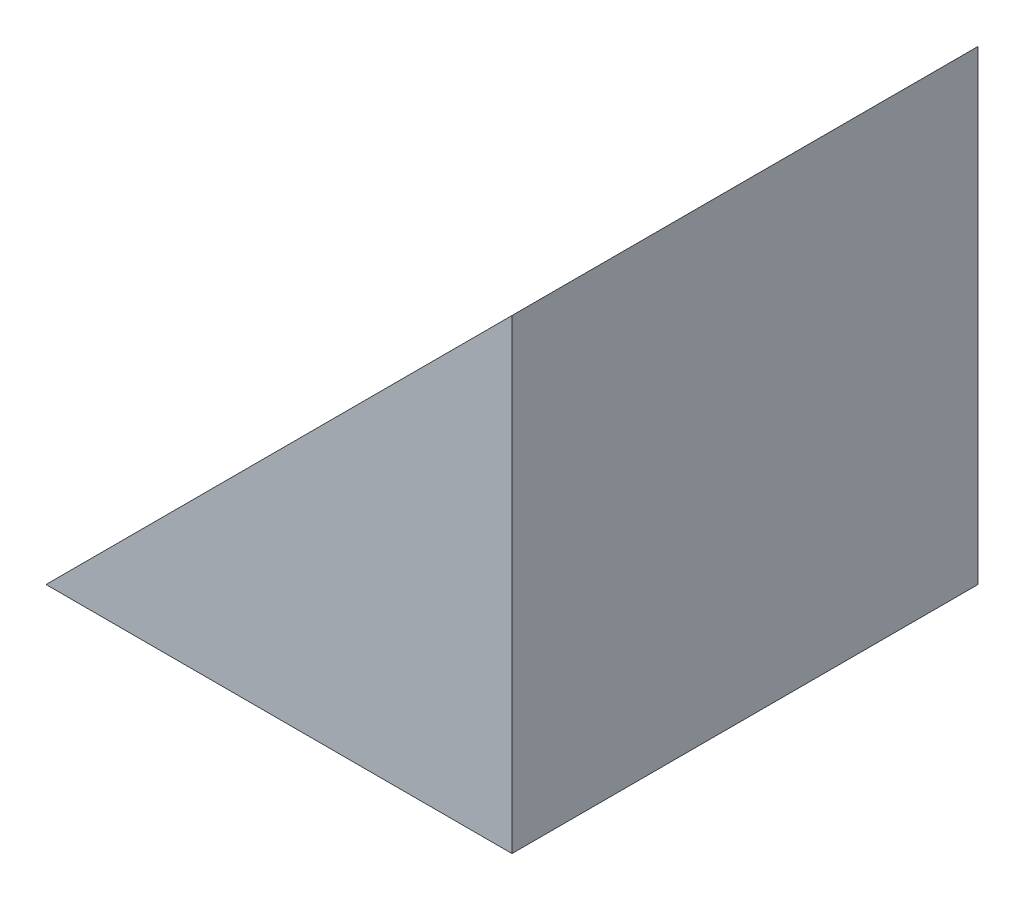
ISO-10303-21;
HEADER;
FILE_DESCRIPTION(('STEP AP214'),'2;1');
FILE_NAME('part.step','',(''),(''),'','','');
FILE_SCHEMA(('AUTOMOTIVE_DESIGN { 1 0 10303 214 1 1 1 1 }'));
ENDSEC;
DATA;
#1=APPLICATION_CONTEXT('core data for automotive mechanical design processes');
#2=APPLICATION_PROTOCOL_DEFINITION('international standard','automotive_design',2000,#1);
#3=PRODUCT_CONTEXT('',#1,'mechanical');
#4=PRODUCT('Part','Part','',(#3));
#5=PRODUCT_RELATED_PRODUCT_CATEGORY('part','',(#4));
#6=PRODUCT_DEFINITION_FORMATION('','',#4);
#7=PRODUCT_DEFINITION_CONTEXT('part definition',#1,'design');
#8=PRODUCT_DEFINITION('design','',#6,#7);
#9=PRODUCT_DEFINITION_SHAPE('','',#8);
#10=(LENGTH_UNIT() NAMED_UNIT(*) SI_UNIT(.MILLI.,.METRE.));
#11=(NAMED_UNIT(*) PLANE_ANGLE_UNIT() SI_UNIT($,.RADIAN.));
#12=(NAMED_UNIT(*) SI_UNIT($,.STERADIAN.) SOLID_ANGLE_UNIT());
#13=UNCERTAINTY_MEASURE_WITH_UNIT(LENGTH_MEASURE(1.E-05),#10,'distance_accuracy_value','');
#14=(GEOMETRIC_REPRESENTATION_CONTEXT(3) GLOBAL_UNCERTAINTY_ASSIGNED_CONTEXT((#13)) GLOBAL_UNIT_ASSIGNED_CONTEXT((#10,
#11,#12)) REPRESENTATION_CONTEXT('',''));
#15=CARTESIAN_POINT('',(0.,0.,0.));
#16=DIRECTION('',(0.,0.,1.));
#17=DIRECTION('',(1.,0.,0.));
#18=AXIS2_PLACEMENT_3D('',#15,#16,#17);
#19=CARTESIAN_POINT('',(104.828438226543,79.6674421441836,30.));
#20=DIRECTION('',(0.,1.,0.));
#21=DIRECTION('',(0.,0.,1.));
#22=AXIS2_PLACEMENT_3D('',#19,#20,#21);
#23=PLANE('',#22);
#24=DIRECTION('',(1.,0.,0.));
#25=VECTOR('',#24,1.);
#26=CARTESIAN_POINT('',(104.828438226543,79.6674421441836,0.));
#27=LINE('',#26,#25);
#28=CARTESIAN_POINT('',(74.8284382265434,79.6674421441836,0.));
#29=VERTEX_POINT('',#28);
#30=CARTESIAN_POINT('',(104.828438226543,79.6674421441836,0.));
#31=VERTEX_POINT('',#30);
#32=EDGE_CURVE('E89',#29,#31,#27,.T.);
#33=ORIENTED_EDGE('',*,*,#32,.T.);
#34=DIRECTION('',(0.,0.,-1.));
#35=VECTOR('',#34,1.);
#36=CARTESIAN_POINT('',(104.828438226543,79.6674421441836,30.));
#37=LINE('',#36,#35);
#38=CARTESIAN_POINT('',(104.828438226543,79.6674421441836,30.));
#39=VERTEX_POINT('',#38);
#40=EDGE_CURVE('E11',#39,#31,#37,.T.);
#41=ORIENTED_EDGE('',*,*,#40,.F.);
#42=DIRECTION('',(1.,0.,0.));
#43=VECTOR('',#42,1.);
#44=CARTESIAN_POINT('',(104.828438226543,79.6674421441836,30.));
#45=LINE('',#44,#43);
#46=CARTESIAN_POINT('',(74.8284382265434,79.6674421441836,30.));
#47=VERTEX_POINT('',#46);
#48=EDGE_CURVE('E81',#47,#39,#45,.T.);
#49=ORIENTED_EDGE('',*,*,#48,.F.);
#50=DIRECTION('',(0.,0.,-1.));
#51=VECTOR('',#50,1.);
#52=CARTESIAN_POINT('',(74.8284382265434,79.6674421441836,30.));
#53=LINE('',#52,#51);
#54=EDGE_CURVE('E90',#47,#29,#53,.T.);
#55=ORIENTED_EDGE('',*,*,#54,.T.);
#56=EDGE_LOOP('',(#33,#41,#49,#55));
#57=FACE_BOUND('',#56,.T.);
#58=ADVANCED_FACE('F39',(#57),#23,.F.);
#59=CARTESIAN_POINT('',(104.828438226543,79.6674421441836,30.));
#60=DIRECTION('',(-1.,0.,0.));
#61=DIRECTION('',(0.,0.,1.));
#62=AXIS2_PLACEMENT_3D('',#59,#60,#61);
#63=PLANE('',#62);
#64=DIRECTION('',(0.,1.,0.));
#65=VECTOR('',#64,1.);
#66=CARTESIAN_POINT('',(104.828438226543,79.6674421441836,0.));
#67=LINE('',#66,#65);
#68=CARTESIAN_POINT('',(104.828438226543,109.667442144184,0.));
#69=VERTEX_POINT('',#68);
#70=EDGE_CURVE('E68',#31,#69,#67,.T.);
#71=ORIENTED_EDGE('',*,*,#70,.T.);
#72=DIRECTION('',(0.,0.,-1.));
#73=VECTOR('',#72,1.);
#74=CARTESIAN_POINT('',(104.828438226543,109.667442144184,30.));
#75=LINE('',#74,#73);
#76=CARTESIAN_POINT('',(104.828438226543,109.667442144184,30.));
#77=VERTEX_POINT('',#76);
#78=EDGE_CURVE('E48',#77,#69,#75,.T.);
#79=ORIENTED_EDGE('',*,*,#78,.F.);
#80=DIRECTION('',(0.,1.,0.));
#81=VECTOR('',#80,1.);
#82=CARTESIAN_POINT('',(104.828438226543,79.6674421441836,30.));
#83=LINE('',#82,#81);
#84=EDGE_CURVE('E76',#39,#77,#83,.T.);
#85=ORIENTED_EDGE('',*,*,#84,.F.);
#86=ORIENTED_EDGE('',*,*,#40,.T.);
#87=EDGE_LOOP('',(#71,#79,#85,#86));
#88=FACE_BOUND('',#87,.T.);
#89=ADVANCED_FACE('F77',(#88),#63,.F.);
#90=CARTESIAN_POINT('',(74.8284382265434,79.6674421441836,30.));
#91=DIRECTION('',(0.707106781186547,-0.707106781186547,0.));
#92=DIRECTION('',(0.707106781186548,0.707106781186548,0.));
#93=AXIS2_PLACEMENT_3D('',#90,#91,#92);
#94=PLANE('',#93);
#95=DIRECTION('',(-0.707106781186547,-0.707106781186547,0.));
#96=VECTOR('',#95,1.);
#97=CARTESIAN_POINT('',(74.8284382265434,79.6674421441836,0.));
#98=LINE('',#97,#96);
#99=EDGE_CURVE('E73',#69,#29,#98,.T.);
#100=ORIENTED_EDGE('',*,*,#99,.T.);
#101=ORIENTED_EDGE('',*,*,#54,.F.);
#102=DIRECTION('',(-0.707106781186547,-0.707106781186547,0.));
#103=VECTOR('',#102,1.);
#104=CARTESIAN_POINT('',(74.8284382265434,79.6674421441836,30.));
#105=LINE('',#104,#103);
#106=EDGE_CURVE('E56',#77,#47,#105,.T.);
#107=ORIENTED_EDGE('',*,*,#106,.F.);
#108=ORIENTED_EDGE('',*,*,#78,.T.);
#109=EDGE_LOOP('',(#100,#101,#107,#108));
#110=FACE_BOUND('',#109,.T.);
#111=ADVANCED_FACE('F102',(#110),#94,.F.);
#112=CARTESIAN_POINT('',(0.,0.,30.));
#113=DIRECTION('',(0.,0.,-1.));
#114=DIRECTION('',(-1.,0.,0.));
#115=AXIS2_PLACEMENT_3D('',#112,#113,#114);
#116=PLANE('',#115);
#117=ORIENTED_EDGE('',*,*,#48,.T.);
#118=ORIENTED_EDGE('',*,*,#84,.T.);
#119=ORIENTED_EDGE('',*,*,#106,.T.);
#120=EDGE_LOOP('',(#117,#118,#119));
#121=FACE_BOUND('',#120,.T.);
#122=ADVANCED_FACE('F84',(#121),#116,.F.);
#123=CARTESIAN_POINT('',(0.,0.,0.));
#124=DIRECTION('',(0.,0.,-1.));
#125=DIRECTION('',(-1.,0.,0.));
#126=AXIS2_PLACEMENT_3D('',#123,#124,#125);
#127=PLANE('',#126);
#128=ORIENTED_EDGE('',*,*,#32,.F.);
#129=ORIENTED_EDGE('',*,*,#99,.F.);
#130=ORIENTED_EDGE('',*,*,#70,.F.);
#131=EDGE_LOOP('',(#128,#129,#130));
#132=FACE_BOUND('',#131,.T.);
#133=ADVANCED_FACE('F103',(#132),#127,.T.);
#134=CLOSED_SHELL('',(#58,#89,#111,#122,#133));
#135=MANIFOLD_SOLID_BREP('B2',#134);
#136=ADVANCED_BREP_SHAPE_REPRESENTATION('',(#18,#135),#14);
#137=SHAPE_DEFINITION_REPRESENTATION(#9,#136);
ENDSEC;
END-ISO-10303-21;
